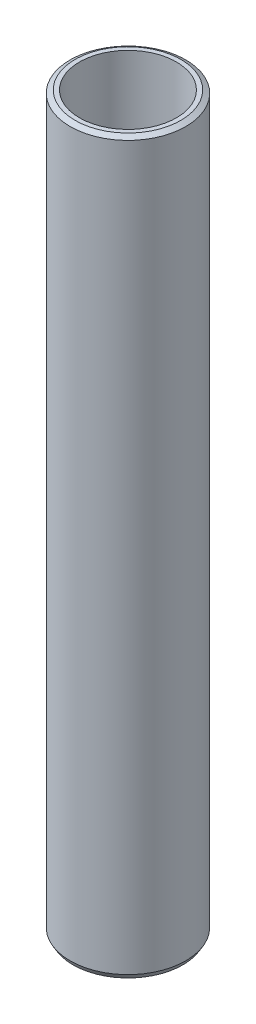
ISO-10303-21;
HEADER;
FILE_DESCRIPTION(('STEP AP214'),'2;1');
FILE_NAME('part.step','',(''),(''),'','','');
FILE_SCHEMA(('AUTOMOTIVE_DESIGN { 1 0 10303 214 1 1 1 1 }'));
ENDSEC;
DATA;
#1=APPLICATION_CONTEXT('core data for automotive mechanical design processes');
#2=APPLICATION_PROTOCOL_DEFINITION('international standard','automotive_design',2000,#1);
#3=PRODUCT_CONTEXT('',#1,'mechanical');
#4=PRODUCT('Part','Part','',(#3));
#5=PRODUCT_RELATED_PRODUCT_CATEGORY('part','',(#4));
#6=PRODUCT_DEFINITION_FORMATION('','',#4);
#7=PRODUCT_DEFINITION_CONTEXT('part definition',#1,'design');
#8=PRODUCT_DEFINITION('design','',#6,#7);
#9=PRODUCT_DEFINITION_SHAPE('','',#8);
#10=(LENGTH_UNIT() NAMED_UNIT(*) SI_UNIT(.MILLI.,.METRE.));
#11=(NAMED_UNIT(*) PLANE_ANGLE_UNIT() SI_UNIT($,.RADIAN.));
#12=(NAMED_UNIT(*) SI_UNIT($,.STERADIAN.) SOLID_ANGLE_UNIT());
#13=UNCERTAINTY_MEASURE_WITH_UNIT(LENGTH_MEASURE(1.E-05),#10,'distance_accuracy_value','');
#14=(GEOMETRIC_REPRESENTATION_CONTEXT(3) GLOBAL_UNCERTAINTY_ASSIGNED_CONTEXT((#13)) GLOBAL_UNIT_ASSIGNED_CONTEXT((#10,
#11,#12)) REPRESENTATION_CONTEXT('',''));
#15=CARTESIAN_POINT('',(0.,0.,0.));
#16=DIRECTION('',(0.,0.,1.));
#17=DIRECTION('',(1.,0.,0.));
#18=AXIS2_PLACEMENT_3D('',#15,#16,#17);
#19=CARTESIAN_POINT('',(0.,600.,0.));
#20=DIRECTION('',(0.,-1.,0.));
#21=DIRECTION('',(0.,0.,-1.));
#22=AXIS2_PLACEMENT_3D('',#19,#20,#21);
#23=CYLINDRICAL_SURFACE('',#22,47.5);
#24=CARTESIAN_POINT('',(0.,597.647060094775,0.));
#25=DIRECTION('',(0.,1.,0.));
#26=DIRECTION('',(0.,0.,1.));
#27=AXIS2_PLACEMENT_3D('',#24,#25,#26);
#28=CIRCLE('',#27,47.5);
#29=CARTESIAN_POINT('',(0.,597.647060094775,47.5));
#30=VERTEX_POINT('',#29);
#31=EDGE_CURVE('E50',#30,#30,#28,.F.);
#32=ORIENTED_EDGE('',*,*,#31,.T.);
#33=EDGE_LOOP('',(#32));
#34=FACE_BOUND('',#33,.T.);
#35=CARTESIAN_POINT('',(0.,4.07541146300616,0.));
#36=DIRECTION('',(0.,1.,0.));
#37=DIRECTION('',(0.,0.,1.));
#38=AXIS2_PLACEMENT_3D('',#35,#36,#37);
#39=CIRCLE('',#38,47.5);
#40=CARTESIAN_POINT('',(0.,4.07541146300616,47.5));
#41=VERTEX_POINT('',#40);
#42=EDGE_CURVE('E51',#41,#41,#39,.T.);
#43=ORIENTED_EDGE('',*,*,#42,.T.);
#44=EDGE_LOOP('',(#43));
#45=FACE_BOUND('',#44,.T.);
#46=ADVANCED_FACE('F39',(#34,#45),#23,.T.);
#47=CARTESIAN_POINT('',(0.,600.,0.));
#48=DIRECTION('',(0.,1.,0.));
#49=DIRECTION('',(0.,0.,1.));
#50=AXIS2_PLACEMENT_3D('',#47,#48,#49);
#51=PLANE('',#50);
#52=CARTESIAN_POINT('',(0.,600.,0.));
#53=DIRECTION('',(0.,1.,0.));
#54=DIRECTION('',(0.,0.,1.));
#55=AXIS2_PLACEMENT_3D('',#52,#53,#54);
#56=CIRCLE('',#55,43.4245885369936);
#57=CARTESIAN_POINT('',(0.,600.,43.4245885369936));
#58=VERTEX_POINT('',#57);
#59=EDGE_CURVE('E54',#58,#58,#56,.T.);
#60=ORIENTED_EDGE('',*,*,#59,.T.);
#61=EDGE_LOOP('',(#60));
#62=FACE_BOUND('',#61,.T.);
#63=CARTESIAN_POINT('',(0.,600.,0.));
#64=DIRECTION('',(0.,1.,0.));
#65=DIRECTION('',(0.,0.,1.));
#66=AXIS2_PLACEMENT_3D('',#63,#64,#65);
#67=CIRCLE('',#66,39.8032113697662);
#68=CARTESIAN_POINT('',(0.,600.,39.8032113697662));
#69=VERTEX_POINT('',#68);
#70=EDGE_CURVE('E58',#69,#69,#67,.T.);
#71=ORIENTED_EDGE('',*,*,#70,.F.);
#72=EDGE_LOOP('',(#71));
#73=FACE_BOUND('',#72,.T.);
#74=ADVANCED_FACE('F69',(#62,#73),#51,.T.);
#75=CARTESIAN_POINT('',(0.,0.,0.));
#76=DIRECTION('',(0.,1.,0.));
#77=DIRECTION('',(0.,0.,1.));
#78=AXIS2_PLACEMENT_3D('',#75,#76,#77);
#79=PLANE('',#78);
#80=CARTESIAN_POINT('',(0.,0.,0.));
#81=DIRECTION('',(0.,1.,0.));
#82=DIRECTION('',(0.,0.,1.));
#83=AXIS2_PLACEMENT_3D('',#80,#81,#82);
#84=CIRCLE('',#83,45.1470600947749);
#85=CARTESIAN_POINT('',(0.,0.,45.1470600947749));
#86=VERTEX_POINT('',#85);
#87=EDGE_CURVE('E10',#86,#86,#84,.F.);
#88=ORIENTED_EDGE('',*,*,#87,.T.);
#89=EDGE_LOOP('',(#88));
#90=FACE_BOUND('',#89,.T.);
#91=CARTESIAN_POINT('',(0.,0.,0.));
#92=DIRECTION('',(0.,1.,0.));
#93=DIRECTION('',(0.,0.,1.));
#94=AXIS2_PLACEMENT_3D('',#91,#92,#93);
#95=CIRCLE('',#94,39.8032113697662);
#96=CARTESIAN_POINT('',(0.,0.,39.8032113697662));
#97=VERTEX_POINT('',#96);
#98=EDGE_CURVE('E63',#97,#97,#95,.T.);
#99=ORIENTED_EDGE('',*,*,#98,.T.);
#100=EDGE_LOOP('',(#99));
#101=FACE_BOUND('',#100,.T.);
#102=ADVANCED_FACE('F75',(#90,#101),#79,.F.);
#103=CARTESIAN_POINT('',(0.,600.,0.));
#104=DIRECTION('',(0.,-1.,0.));
#105=DIRECTION('',(0.,0.,-1.));
#106=AXIS2_PLACEMENT_3D('',#103,#104,#105);
#107=CYLINDRICAL_SURFACE('',#106,39.8032113697662);
#108=ORIENTED_EDGE('',*,*,#70,.T.);
#109=EDGE_LOOP('',(#108));
#110=FACE_BOUND('',#109,.T.);
#111=ORIENTED_EDGE('',*,*,#98,.F.);
#112=EDGE_LOOP('',(#111));
#113=FACE_BOUND('',#112,.T.);
#114=ADVANCED_FACE('F70',(#110,#113),#107,.F.);
#115=CARTESIAN_POINT('',(0.,600.,0.));
#116=DIRECTION('',(0.,-1.,0.));
#117=DIRECTION('',(0.,0.,-1.));
#118=AXIS2_PLACEMENT_3D('',#115,#116,#117);
#119=CONICAL_SURFACE('',#118,43.4245885369936,1.04719755119658);
#120=ORIENTED_EDGE('',*,*,#31,.F.);
#121=EDGE_LOOP('',(#120));
#122=FACE_BOUND('',#121,.T.);
#123=ORIENTED_EDGE('',*,*,#59,.F.);
#124=EDGE_LOOP('',(#123));
#125=FACE_BOUND('',#124,.T.);
#126=ADVANCED_FACE('F81',(#122,#125),#119,.T.);
#127=CARTESIAN_POINT('',(0.,4.07541146300616,0.));
#128=DIRECTION('',(0.,1.,0.));
#129=DIRECTION('',(0.,0.,1.));
#130=AXIS2_PLACEMENT_3D('',#127,#128,#129);
#131=CONICAL_SURFACE('',#130,47.5,0.523598775598307);
#132=ORIENTED_EDGE('',*,*,#87,.F.);
#133=EDGE_LOOP('',(#132));
#134=FACE_BOUND('',#133,.T.);
#135=ORIENTED_EDGE('',*,*,#42,.F.);
#136=EDGE_LOOP('',(#135));
#137=FACE_BOUND('',#136,.T.);
#138=ADVANCED_FACE('F45',(#134,#137),#131,.T.);
#139=CLOSED_SHELL('',(#46,#74,#102,#114,#126,#138));
#140=MANIFOLD_SOLID_BREP('B2',#139);
#141=ADVANCED_BREP_SHAPE_REPRESENTATION('',(#18,#140),#14);
#142=SHAPE_DEFINITION_REPRESENTATION(#9,#141);
ENDSEC;
END-ISO-10303-21;
